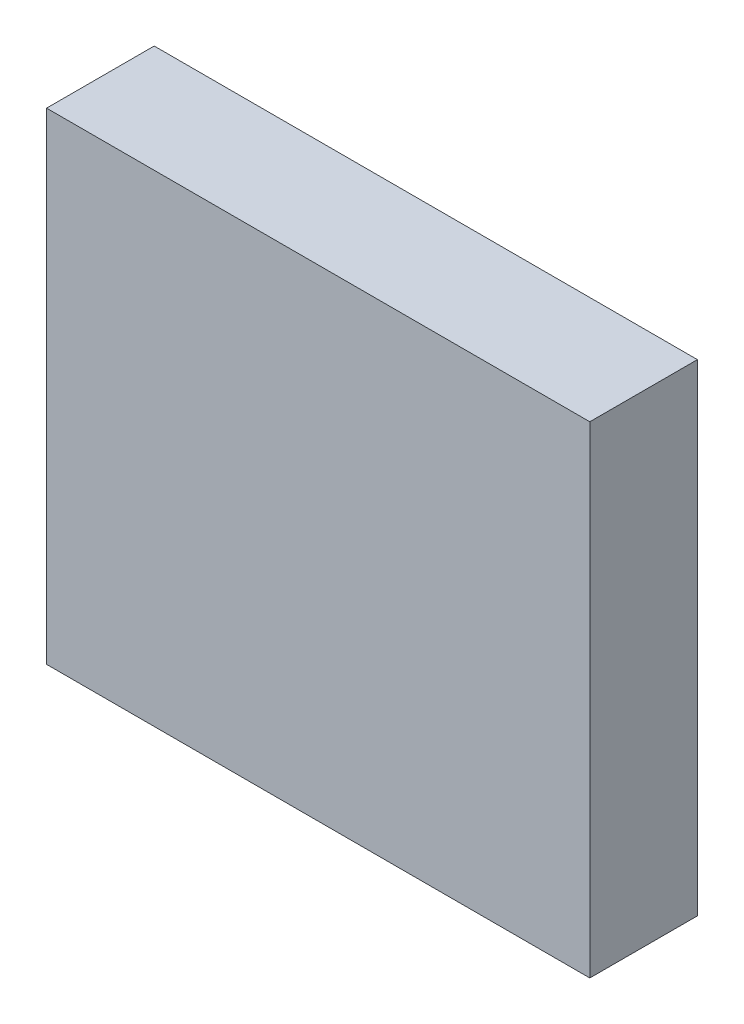
ISO-10303-21;
HEADER;
FILE_DESCRIPTION(('STEP AP214'),'2;1');
FILE_NAME('part.step','',(''),(''),'','','');
FILE_SCHEMA(('AUTOMOTIVE_DESIGN { 1 0 10303 214 1 1 1 1 }'));
ENDSEC;
DATA;
#1=APPLICATION_CONTEXT('core data for automotive mechanical design processes');
#2=APPLICATION_PROTOCOL_DEFINITION('international standard','automotive_design',2000,#1);
#3=PRODUCT_CONTEXT('',#1,'mechanical');
#4=PRODUCT('Part','Part','',(#3));
#5=PRODUCT_RELATED_PRODUCT_CATEGORY('part','',(#4));
#6=PRODUCT_DEFINITION_FORMATION('','',#4);
#7=PRODUCT_DEFINITION_CONTEXT('part definition',#1,'design');
#8=PRODUCT_DEFINITION('design','',#6,#7);
#9=PRODUCT_DEFINITION_SHAPE('','',#8);
#10=(LENGTH_UNIT() NAMED_UNIT(*) SI_UNIT(.MILLI.,.METRE.));
#11=(NAMED_UNIT(*) PLANE_ANGLE_UNIT() SI_UNIT($,.RADIAN.));
#12=(NAMED_UNIT(*) SI_UNIT($,.STERADIAN.) SOLID_ANGLE_UNIT());
#13=UNCERTAINTY_MEASURE_WITH_UNIT(LENGTH_MEASURE(1.E-05),#10,'distance_accuracy_value','');
#14=(GEOMETRIC_REPRESENTATION_CONTEXT(3) GLOBAL_UNCERTAINTY_ASSIGNED_CONTEXT((#13)) GLOBAL_UNIT_ASSIGNED_CONTEXT((#10,
#11,#12)) REPRESENTATION_CONTEXT('',''));
#15=CARTESIAN_POINT('',(0.,0.,0.));
#16=DIRECTION('',(0.,0.,1.));
#17=DIRECTION('',(1.,0.,0.));
#18=AXIS2_PLACEMENT_3D('',#15,#16,#17);
#19=CARTESIAN_POINT('',(-2.64999978,-2.35000038,1.05000044));
#20=DIRECTION('',(0.,0.,-1.));
#21=DIRECTION('',(-1.,0.,0.));
#22=AXIS2_PLACEMENT_3D('',#19,#20,#21);
#23=PLANE('',#22);
#24=DIRECTION('',(0.,1.,0.));
#25=VECTOR('',#24,1.);
#26=CARTESIAN_POINT('',(2.64999978,-2.35000038,1.05000044));
#27=LINE('',#26,#25);
#28=CARTESIAN_POINT('',(2.64999978,-2.35000038,1.05000044));
#29=VERTEX_POINT('',#28);
#30=CARTESIAN_POINT('',(2.64999978,2.35000038,1.05000044));
#31=VERTEX_POINT('',#30);
#32=EDGE_CURVE('E54',#29,#31,#27,.T.);
#33=ORIENTED_EDGE('',*,*,#32,.T.);
#34=DIRECTION('',(1.,0.,0.));
#35=VECTOR('',#34,1.);
#36=CARTESIAN_POINT('',(2.64999978,2.35000038,1.05000044));
#37=LINE('',#36,#35);
#38=CARTESIAN_POINT('',(-2.64999978,2.35000038,1.05000044));
#39=VERTEX_POINT('',#38);
#40=EDGE_CURVE('E56',#31,#39,#37,.F.);
#41=ORIENTED_EDGE('',*,*,#40,.T.);
#42=DIRECTION('',(0.,1.,0.));
#43=VECTOR('',#42,1.);
#44=CARTESIAN_POINT('',(-2.64999978,2.35000038,1.05000044));
#45=LINE('',#44,#43);
#46=CARTESIAN_POINT('',(-2.64999978,-2.35000038,1.05000044));
#47=VERTEX_POINT('',#46);
#48=EDGE_CURVE('E19',#39,#47,#45,.F.);
#49=ORIENTED_EDGE('',*,*,#48,.T.);
#50=DIRECTION('',(1.,0.,0.));
#51=VECTOR('',#50,1.);
#52=CARTESIAN_POINT('',(-2.64999978,-2.35000038,1.05000044));
#53=LINE('',#52,#51);
#54=EDGE_CURVE('E79',#47,#29,#53,.T.);
#55=ORIENTED_EDGE('',*,*,#54,.T.);
#56=EDGE_LOOP('',(#33,#41,#49,#55));
#57=FACE_BOUND('',#56,.T.);
#58=ADVANCED_FACE('F16',(#57),#23,.F.);
#59=CARTESIAN_POINT('',(-2.64999978,2.35000038,0.));
#60=DIRECTION('',(1.,0.,0.));
#61=DIRECTION('',(0.,0.,-1.));
#62=AXIS2_PLACEMENT_3D('',#59,#60,#61);
#63=PLANE('',#62);
#64=DIRECTION('',(0.,0.,1.));
#65=VECTOR('',#64,1.);
#66=CARTESIAN_POINT('',(-2.64999978,-2.35000038,0.));
#67=LINE('',#66,#65);
#68=CARTESIAN_POINT('',(-2.64999978,-2.35000038,0.));
#69=VERTEX_POINT('',#68);
#70=EDGE_CURVE('E67',#69,#47,#67,.T.);
#71=ORIENTED_EDGE('',*,*,#70,.T.);
#72=ORIENTED_EDGE('',*,*,#48,.F.);
#73=DIRECTION('',(0.,0.,-1.));
#74=VECTOR('',#73,1.);
#75=CARTESIAN_POINT('',(-2.64999978,2.35000038,0.));
#76=LINE('',#75,#74);
#77=CARTESIAN_POINT('',(-2.64999978,2.35000038,0.));
#78=VERTEX_POINT('',#77);
#79=EDGE_CURVE('E62',#39,#78,#76,.T.);
#80=ORIENTED_EDGE('',*,*,#79,.T.);
#81=DIRECTION('',(0.,1.,0.));
#82=VECTOR('',#81,1.);
#83=CARTESIAN_POINT('',(-2.64999978,-2.35000038,0.));
#84=LINE('',#83,#82);
#85=EDGE_CURVE('E82',#69,#78,#84,.T.);
#86=ORIENTED_EDGE('',*,*,#85,.F.);
#87=EDGE_LOOP('',(#71,#72,#80,#86));
#88=FACE_BOUND('',#87,.T.);
#89=ADVANCED_FACE('F64',(#88),#63,.F.);
#90=CARTESIAN_POINT('',(2.64999978,2.35000038,0.));
#91=DIRECTION('',(0.,-1.,0.));
#92=DIRECTION('',(0.,0.,-1.));
#93=AXIS2_PLACEMENT_3D('',#90,#91,#92);
#94=PLANE('',#93);
#95=ORIENTED_EDGE('',*,*,#79,.F.);
#96=ORIENTED_EDGE('',*,*,#40,.F.);
#97=DIRECTION('',(0.,0.,1.));
#98=VECTOR('',#97,1.);
#99=CARTESIAN_POINT('',(2.64999978,2.35000038,0.));
#100=LINE('',#99,#98);
#101=CARTESIAN_POINT('',(2.64999978,2.35000038,0.));
#102=VERTEX_POINT('',#101);
#103=EDGE_CURVE('E74',#31,#102,#100,.F.);
#104=ORIENTED_EDGE('',*,*,#103,.T.);
#105=DIRECTION('',(-1.,0.,0.));
#106=VECTOR('',#105,1.);
#107=CARTESIAN_POINT('',(-2.64999978,2.35000038,0.));
#108=LINE('',#107,#106);
#109=EDGE_CURVE('E71',#78,#102,#108,.F.);
#110=ORIENTED_EDGE('',*,*,#109,.F.);
#111=EDGE_LOOP('',(#95,#96,#104,#110));
#112=FACE_BOUND('',#111,.T.);
#113=ADVANCED_FACE('F69',(#112),#94,.F.);
#114=CARTESIAN_POINT('',(2.64999978,-2.35000038,0.));
#115=DIRECTION('',(-1.,0.,0.));
#116=DIRECTION('',(0.,0.,1.));
#117=AXIS2_PLACEMENT_3D('',#114,#115,#116);
#118=PLANE('',#117);
#119=ORIENTED_EDGE('',*,*,#103,.F.);
#120=ORIENTED_EDGE('',*,*,#32,.F.);
#121=DIRECTION('',(0.,0.,1.));
#122=VECTOR('',#121,1.);
#123=CARTESIAN_POINT('',(2.64999978,-2.35000038,0.));
#124=LINE('',#123,#122);
#125=CARTESIAN_POINT('',(2.64999978,-2.35000038,0.));
#126=VERTEX_POINT('',#125);
#127=EDGE_CURVE('E34',#29,#126,#124,.F.);
#128=ORIENTED_EDGE('',*,*,#127,.T.);
#129=DIRECTION('',(0.,1.,0.));
#130=VECTOR('',#129,1.);
#131=CARTESIAN_POINT('',(2.64999978,-2.35000038,0.));
#132=LINE('',#131,#130);
#133=EDGE_CURVE('E25',#102,#126,#132,.F.);
#134=ORIENTED_EDGE('',*,*,#133,.F.);
#135=EDGE_LOOP('',(#119,#120,#128,#134));
#136=FACE_BOUND('',#135,.T.);
#137=ADVANCED_FACE('F88',(#136),#118,.F.);
#138=CARTESIAN_POINT('',(-2.64999978,-2.35000038,0.));
#139=DIRECTION('',(0.,1.,0.));
#140=DIRECTION('',(0.,0.,1.));
#141=AXIS2_PLACEMENT_3D('',#138,#139,#140);
#142=PLANE('',#141);
#143=ORIENTED_EDGE('',*,*,#127,.F.);
#144=ORIENTED_EDGE('',*,*,#54,.F.);
#145=ORIENTED_EDGE('',*,*,#70,.F.);
#146=DIRECTION('',(-1.,0.,0.));
#147=VECTOR('',#146,1.);
#148=CARTESIAN_POINT('',(-2.64999978,-2.35000038,0.));
#149=LINE('',#148,#147);
#150=EDGE_CURVE('E11',#126,#69,#149,.T.);
#151=ORIENTED_EDGE('',*,*,#150,.F.);
#152=EDGE_LOOP('',(#143,#144,#145,#151));
#153=FACE_BOUND('',#152,.T.);
#154=ADVANCED_FACE('F90',(#153),#142,.F.);
#155=CARTESIAN_POINT('',(-2.64999978,-2.35000038,0.));
#156=DIRECTION('',(0.,0.,-1.));
#157=DIRECTION('',(-1.,0.,0.));
#158=AXIS2_PLACEMENT_3D('',#155,#156,#157);
#159=PLANE('',#158);
#160=ORIENTED_EDGE('',*,*,#133,.T.);
#161=ORIENTED_EDGE('',*,*,#150,.T.);
#162=ORIENTED_EDGE('',*,*,#85,.T.);
#163=ORIENTED_EDGE('',*,*,#109,.T.);
#164=EDGE_LOOP('',(#160,#161,#162,#163));
#165=FACE_BOUND('',#164,.T.);
#166=ADVANCED_FACE('F87',(#165),#159,.T.);
#167=CLOSED_SHELL('',(#58,#89,#113,#137,#154,#166));
#168=MANIFOLD_SOLID_BREP('B1',#167);
#169=ADVANCED_BREP_SHAPE_REPRESENTATION('',(#18,#168),#14);
#170=SHAPE_DEFINITION_REPRESENTATION(#9,#169);
ENDSEC;
END-ISO-10303-21;
